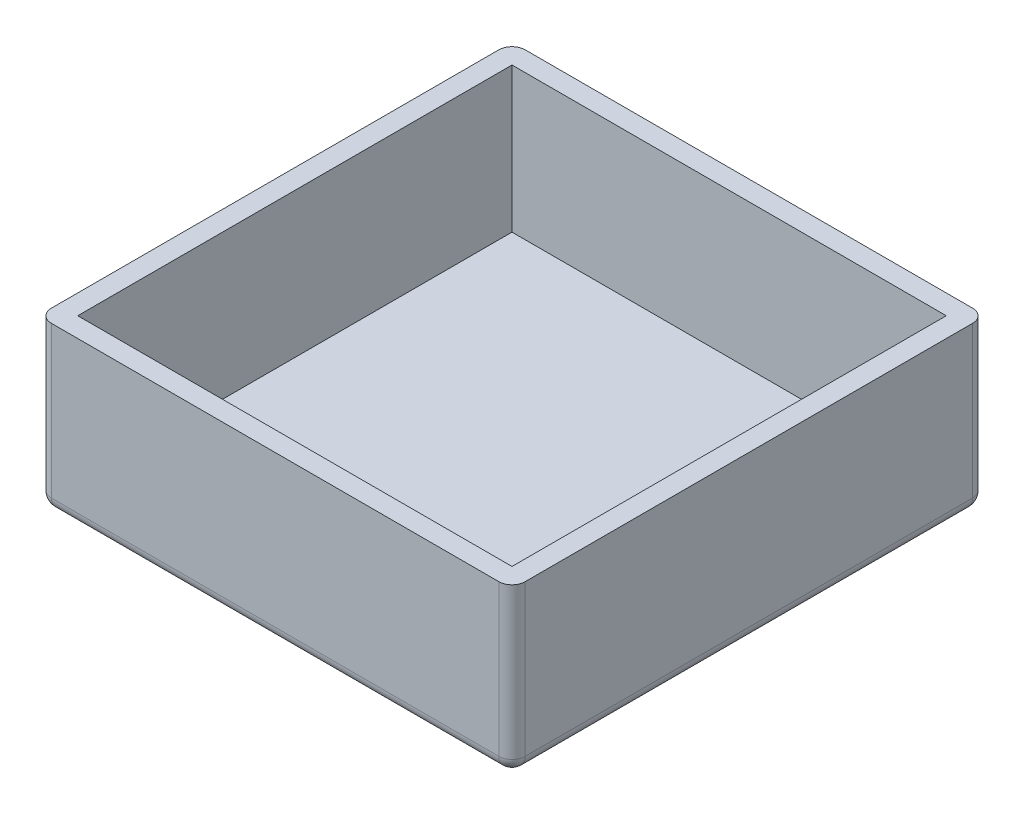
ISO-10303-21;
HEADER;
FILE_DESCRIPTION(('STEP AP214'),'2;1');
FILE_NAME('part.step','',(''),(''),'','','');
FILE_SCHEMA(('AUTOMOTIVE_DESIGN { 1 0 10303 214 1 1 1 1 }'));
ENDSEC;
DATA;
#1=APPLICATION_CONTEXT('core data for automotive mechanical design processes');
#2=APPLICATION_PROTOCOL_DEFINITION('international standard','automotive_design',2000,#1);
#3=PRODUCT_CONTEXT('',#1,'mechanical');
#4=PRODUCT('Part','Part','',(#3));
#5=PRODUCT_RELATED_PRODUCT_CATEGORY('part','',(#4));
#6=PRODUCT_DEFINITION_FORMATION('','',#4);
#7=PRODUCT_DEFINITION_CONTEXT('part definition',#1,'design');
#8=PRODUCT_DEFINITION('design','',#6,#7);
#9=PRODUCT_DEFINITION_SHAPE('','',#8);
#10=(LENGTH_UNIT() NAMED_UNIT(*) SI_UNIT(.MILLI.,.METRE.));
#11=(NAMED_UNIT(*) PLANE_ANGLE_UNIT() SI_UNIT($,.RADIAN.));
#12=(NAMED_UNIT(*) SI_UNIT($,.STERADIAN.) SOLID_ANGLE_UNIT());
#13=UNCERTAINTY_MEASURE_WITH_UNIT(LENGTH_MEASURE(1.E-05),#10,'distance_accuracy_value','');
#14=(GEOMETRIC_REPRESENTATION_CONTEXT(3) GLOBAL_UNCERTAINTY_ASSIGNED_CONTEXT((#13)) GLOBAL_UNIT_ASSIGNED_CONTEXT((#10,
#11,#12)) REPRESENTATION_CONTEXT('',''));
#15=CARTESIAN_POINT('',(0.,0.,0.));
#16=DIRECTION('',(0.,0.,1.));
#17=DIRECTION('',(1.,0.,0.));
#18=AXIS2_PLACEMENT_3D('',#15,#16,#17);
#19=CARTESIAN_POINT('',(0.,3.,0.));
#20=DIRECTION('',(0.,1.,0.));
#21=DIRECTION('',(0.,0.,1.));
#22=AXIS2_PLACEMENT_3D('',#19,#20,#21);
#23=PLANE('',#22);
#24=DIRECTION('',(0.,0.,-1.));
#25=VECTOR('',#24,1.);
#26=CARTESIAN_POINT('',(33.,3.,-33.));
#27=LINE('',#26,#25);
#28=CARTESIAN_POINT('',(33.,3.,33.));
#29=VERTEX_POINT('',#28);
#30=CARTESIAN_POINT('',(33.,3.,-33.));
#31=VERTEX_POINT('',#30);
#32=EDGE_CURVE('E211',#29,#31,#27,.T.);
#33=ORIENTED_EDGE('',*,*,#32,.T.);
#34=DIRECTION('',(-1.,0.,0.));
#35=VECTOR('',#34,1.);
#36=CARTESIAN_POINT('',(-33.,3.,-33.));
#37=LINE('',#36,#35);
#38=CARTESIAN_POINT('',(-33.,3.,-33.));
#39=VERTEX_POINT('',#38);
#40=EDGE_CURVE('E182',#31,#39,#37,.T.);
#41=ORIENTED_EDGE('',*,*,#40,.T.);
#42=DIRECTION('',(0.,0.,1.));
#43=VECTOR('',#42,1.);
#44=CARTESIAN_POINT('',(-33.,3.,-33.));
#45=LINE('',#44,#43);
#46=CARTESIAN_POINT('',(-33.,3.,33.));
#47=VERTEX_POINT('',#46);
#48=EDGE_CURVE('E214',#39,#47,#45,.T.);
#49=ORIENTED_EDGE('',*,*,#48,.T.);
#50=DIRECTION('',(1.,0.,0.));
#51=VECTOR('',#50,1.);
#52=CARTESIAN_POINT('',(-33.,3.,33.));
#53=LINE('',#52,#51);
#54=EDGE_CURVE('E217',#47,#29,#53,.T.);
#55=ORIENTED_EDGE('',*,*,#54,.T.);
#56=EDGE_LOOP('',(#33,#41,#49,#55));
#57=FACE_BOUND('',#56,.T.);
#58=ADVANCED_FACE('F63',(#57),#23,.T.);
#59=CARTESIAN_POINT('',(0.,25.,0.));
#60=DIRECTION('',(0.,1.,0.));
#61=DIRECTION('',(0.,0.,1.));
#62=AXIS2_PLACEMENT_3D('',#59,#60,#61);
#63=PLANE('',#62);
#64=DIRECTION('',(-1.,0.,0.));
#65=VECTOR('',#64,1.);
#66=CARTESIAN_POINT('',(-33.,25.,-36.));
#67=LINE('',#66,#65);
#68=CARTESIAN_POINT('',(34.,25.,-36.));
#69=VERTEX_POINT('',#68);
#70=CARTESIAN_POINT('',(-34.,25.,-36.));
#71=VERTEX_POINT('',#70);
#72=EDGE_CURVE('E202',#69,#71,#67,.T.);
#73=ORIENTED_EDGE('',*,*,#72,.T.);
#74=CARTESIAN_POINT('',(-34.,25.,-34.));
#75=DIRECTION('',(0.,1.,0.));
#76=DIRECTION('',(0.,0.,1.));
#77=AXIS2_PLACEMENT_3D('',#74,#75,#76);
#78=CIRCLE('',#77,2.);
#79=CARTESIAN_POINT('',(-36.,25.,-34.));
#80=VERTEX_POINT('',#79);
#81=EDGE_CURVE('E12',#71,#80,#78,.T.);
#82=ORIENTED_EDGE('',*,*,#81,.T.);
#83=DIRECTION('',(0.,0.,1.));
#84=VECTOR('',#83,1.);
#85=CARTESIAN_POINT('',(-36.,25.,-33.));
#86=LINE('',#85,#84);
#87=CARTESIAN_POINT('',(-36.,25.,34.));
#88=VERTEX_POINT('',#87);
#89=EDGE_CURVE('E205',#80,#88,#86,.T.);
#90=ORIENTED_EDGE('',*,*,#89,.T.);
#91=CARTESIAN_POINT('',(-34.,25.,34.));
#92=DIRECTION('',(0.,1.,0.));
#93=DIRECTION('',(0.,0.,1.));
#94=AXIS2_PLACEMENT_3D('',#91,#92,#93);
#95=CIRCLE('',#94,2.);
#96=CARTESIAN_POINT('',(-34.,25.,36.));
#97=VERTEX_POINT('',#96);
#98=EDGE_CURVE('E252',#88,#97,#95,.T.);
#99=ORIENTED_EDGE('',*,*,#98,.T.);
#100=DIRECTION('',(1.,0.,0.));
#101=VECTOR('',#100,1.);
#102=CARTESIAN_POINT('',(-33.,25.,36.));
#103=LINE('',#102,#101);
#104=CARTESIAN_POINT('',(34.,25.,36.));
#105=VERTEX_POINT('',#104);
#106=EDGE_CURVE('E208',#97,#105,#103,.T.);
#107=ORIENTED_EDGE('',*,*,#106,.T.);
#108=CARTESIAN_POINT('',(34.,25.,34.));
#109=DIRECTION('',(0.,1.,0.));
#110=DIRECTION('',(0.,0.,1.));
#111=AXIS2_PLACEMENT_3D('',#108,#109,#110);
#112=CIRCLE('',#111,2.);
#113=CARTESIAN_POINT('',(36.,25.,34.));
#114=VERTEX_POINT('',#113);
#115=EDGE_CURVE('E254',#105,#114,#112,.T.);
#116=ORIENTED_EDGE('',*,*,#115,.T.);
#117=DIRECTION('',(0.,0.,-1.));
#118=VECTOR('',#117,1.);
#119=CARTESIAN_POINT('',(36.,25.,-33.));
#120=LINE('',#119,#118);
#121=CARTESIAN_POINT('',(36.,25.,-34.));
#122=VERTEX_POINT('',#121);
#123=EDGE_CURVE('E183',#114,#122,#120,.T.);
#124=ORIENTED_EDGE('',*,*,#123,.T.);
#125=CARTESIAN_POINT('',(34.,25.,-34.));
#126=DIRECTION('',(0.,1.,0.));
#127=DIRECTION('',(0.,0.,1.));
#128=AXIS2_PLACEMENT_3D('',#125,#126,#127);
#129=CIRCLE('',#128,2.);
#130=EDGE_CURVE('E72',#122,#69,#129,.T.);
#131=ORIENTED_EDGE('',*,*,#130,.T.);
#132=EDGE_LOOP('',(#73,#82,#90,#99,#107,#116,#124,#131));
#133=FACE_BOUND('',#132,.T.);
#134=DIRECTION('',(-1.,0.,0.));
#135=VECTOR('',#134,1.);
#136=CARTESIAN_POINT('',(-33.,25.,-33.));
#137=LINE('',#136,#135);
#138=CARTESIAN_POINT('',(33.,25.,-33.));
#139=VERTEX_POINT('',#138);
#140=CARTESIAN_POINT('',(-33.,25.,-33.));
#141=VERTEX_POINT('',#140);
#142=EDGE_CURVE('E175',#139,#141,#137,.T.);
#143=ORIENTED_EDGE('',*,*,#142,.F.);
#144=DIRECTION('',(0.,0.,-1.));
#145=VECTOR('',#144,1.);
#146=CARTESIAN_POINT('',(33.,25.,-33.));
#147=LINE('',#146,#145);
#148=CARTESIAN_POINT('',(33.,25.,33.));
#149=VERTEX_POINT('',#148);
#150=EDGE_CURVE('E165',#149,#139,#147,.T.);
#151=ORIENTED_EDGE('',*,*,#150,.F.);
#152=DIRECTION('',(1.,0.,0.));
#153=VECTOR('',#152,1.);
#154=CARTESIAN_POINT('',(-33.,25.,33.));
#155=LINE('',#154,#153);
#156=CARTESIAN_POINT('',(-33.,25.,33.));
#157=VERTEX_POINT('',#156);
#158=EDGE_CURVE('E191',#157,#149,#155,.T.);
#159=ORIENTED_EDGE('',*,*,#158,.F.);
#160=DIRECTION('',(0.,0.,1.));
#161=VECTOR('',#160,1.);
#162=CARTESIAN_POINT('',(-33.,25.,-33.));
#163=LINE('',#162,#161);
#164=EDGE_CURVE('E189',#141,#157,#163,.T.);
#165=ORIENTED_EDGE('',*,*,#164,.F.);
#166=EDGE_LOOP('',(#143,#151,#159,#165));
#167=FACE_BOUND('',#166,.T.);
#168=ADVANCED_FACE('F187',(#133,#167),#63,.T.);
#169=CARTESIAN_POINT('',(36.,25.,-33.));
#170=DIRECTION('',(-1.,0.,0.));
#171=DIRECTION('',(0.,0.,1.));
#172=AXIS2_PLACEMENT_3D('',#169,#170,#171);
#173=PLANE('',#172);
#174=DIRECTION('',(0.,0.,-1.));
#175=VECTOR('',#174,1.);
#176=CARTESIAN_POINT('',(36.,2.,-33.));
#177=LINE('',#176,#175);
#178=CARTESIAN_POINT('',(36.,2.,34.));
#179=VERTEX_POINT('',#178);
#180=CARTESIAN_POINT('',(36.,2.,-34.));
#181=VERTEX_POINT('',#180);
#182=EDGE_CURVE('E222',#179,#181,#177,.T.);
#183=ORIENTED_EDGE('',*,*,#182,.T.);
#184=DIRECTION('',(0.,-1.,0.));
#185=VECTOR('',#184,1.);
#186=CARTESIAN_POINT('',(36.,25.,-34.));
#187=LINE('',#186,#185);
#188=EDGE_CURVE('E225',#181,#122,#187,.F.);
#189=ORIENTED_EDGE('',*,*,#188,.T.);
#190=ORIENTED_EDGE('',*,*,#123,.F.);
#191=DIRECTION('',(0.,-1.,0.));
#192=VECTOR('',#191,1.);
#193=CARTESIAN_POINT('',(36.,25.,34.));
#194=LINE('',#193,#192);
#195=EDGE_CURVE('E220',#114,#179,#194,.T.);
#196=ORIENTED_EDGE('',*,*,#195,.T.);
#197=EDGE_LOOP('',(#183,#189,#190,#196));
#198=FACE_BOUND('',#197,.T.);
#199=ADVANCED_FACE('F315',(#198),#173,.F.);
#200=CARTESIAN_POINT('',(-33.,25.,-36.));
#201=DIRECTION('',(0.,0.,1.));
#202=DIRECTION('',(1.,0.,0.));
#203=AXIS2_PLACEMENT_3D('',#200,#201,#202);
#204=PLANE('',#203);
#205=DIRECTION('',(-1.,0.,0.));
#206=VECTOR('',#205,1.);
#207=CARTESIAN_POINT('',(-33.,2.,-36.));
#208=LINE('',#207,#206);
#209=CARTESIAN_POINT('',(34.,2.,-36.));
#210=VERTEX_POINT('',#209);
#211=CARTESIAN_POINT('',(-34.,2.,-36.));
#212=VERTEX_POINT('',#211);
#213=EDGE_CURVE('E80',#210,#212,#208,.T.);
#214=ORIENTED_EDGE('',*,*,#213,.T.);
#215=DIRECTION('',(0.,-1.,0.));
#216=VECTOR('',#215,1.);
#217=CARTESIAN_POINT('',(-34.,25.,-36.));
#218=LINE('',#217,#216);
#219=EDGE_CURVE('E250',#212,#71,#218,.F.);
#220=ORIENTED_EDGE('',*,*,#219,.T.);
#221=ORIENTED_EDGE('',*,*,#72,.F.);
#222=DIRECTION('',(0.,-1.,0.));
#223=VECTOR('',#222,1.);
#224=CARTESIAN_POINT('',(34.,25.,-36.));
#225=LINE('',#224,#223);
#226=EDGE_CURVE('E85',#69,#210,#225,.T.);
#227=ORIENTED_EDGE('',*,*,#226,.T.);
#228=EDGE_LOOP('',(#214,#220,#221,#227));
#229=FACE_BOUND('',#228,.T.);
#230=ADVANCED_FACE('F322',(#229),#204,.F.);
#231=CARTESIAN_POINT('',(-36.,25.,-33.));
#232=DIRECTION('',(1.,0.,0.));
#233=DIRECTION('',(0.,0.,-1.));
#234=AXIS2_PLACEMENT_3D('',#231,#232,#233);
#235=PLANE('',#234);
#236=ORIENTED_EDGE('',*,*,#89,.F.);
#237=DIRECTION('',(0.,-1.,0.));
#238=VECTOR('',#237,1.);
#239=CARTESIAN_POINT('',(-36.,25.,-34.));
#240=LINE('',#239,#238);
#241=CARTESIAN_POINT('',(-36.,2.,-34.));
#242=VERTEX_POINT('',#241);
#243=EDGE_CURVE('E246',#80,#242,#240,.T.);
#244=ORIENTED_EDGE('',*,*,#243,.T.);
#245=DIRECTION('',(0.,0.,1.));
#246=VECTOR('',#245,1.);
#247=CARTESIAN_POINT('',(-36.,2.,-33.));
#248=LINE('',#247,#246);
#249=CARTESIAN_POINT('',(-36.,2.,34.));
#250=VERTEX_POINT('',#249);
#251=EDGE_CURVE('E244',#242,#250,#248,.T.);
#252=ORIENTED_EDGE('',*,*,#251,.T.);
#253=DIRECTION('',(0.,-1.,0.));
#254=VECTOR('',#253,1.);
#255=CARTESIAN_POINT('',(-36.,25.,34.));
#256=LINE('',#255,#254);
#257=EDGE_CURVE('E242',#250,#88,#256,.F.);
#258=ORIENTED_EDGE('',*,*,#257,.T.);
#259=EDGE_LOOP('',(#236,#244,#252,#258));
#260=FACE_BOUND('',#259,.T.);
#261=ADVANCED_FACE('F342',(#260),#235,.F.);
#262=CARTESIAN_POINT('',(-33.,25.,36.));
#263=DIRECTION('',(0.,0.,-1.));
#264=DIRECTION('',(-1.,0.,0.));
#265=AXIS2_PLACEMENT_3D('',#262,#263,#264);
#266=PLANE('',#265);
#267=DIRECTION('',(1.,0.,0.));
#268=VECTOR('',#267,1.);
#269=CARTESIAN_POINT('',(-33.,2.,36.));
#270=LINE('',#269,#268);
#271=CARTESIAN_POINT('',(-34.,2.,36.));
#272=VERTEX_POINT('',#271);
#273=CARTESIAN_POINT('',(34.,2.,36.));
#274=VERTEX_POINT('',#273);
#275=EDGE_CURVE('E238',#272,#274,#270,.T.);
#276=ORIENTED_EDGE('',*,*,#275,.T.);
#277=DIRECTION('',(0.,-1.,0.));
#278=VECTOR('',#277,1.);
#279=CARTESIAN_POINT('',(34.,25.,36.));
#280=LINE('',#279,#278);
#281=EDGE_CURVE('E240',#274,#105,#280,.F.);
#282=ORIENTED_EDGE('',*,*,#281,.T.);
#283=ORIENTED_EDGE('',*,*,#106,.F.);
#284=DIRECTION('',(0.,-1.,0.));
#285=VECTOR('',#284,1.);
#286=CARTESIAN_POINT('',(-34.,25.,36.));
#287=LINE('',#286,#285);
#288=EDGE_CURVE('E236',#97,#272,#287,.T.);
#289=ORIENTED_EDGE('',*,*,#288,.T.);
#290=EDGE_LOOP('',(#276,#282,#283,#289));
#291=FACE_BOUND('',#290,.T.);
#292=ADVANCED_FACE('F302',(#291),#266,.F.);
#293=CARTESIAN_POINT('',(33.,25.,-33.));
#294=DIRECTION('',(-1.,0.,0.));
#295=DIRECTION('',(0.,0.,1.));
#296=AXIS2_PLACEMENT_3D('',#293,#294,#295);
#297=PLANE('',#296);
#298=DIRECTION('',(0.,-1.,0.));
#299=VECTOR('',#298,1.);
#300=CARTESIAN_POINT('',(33.,25.,-33.));
#301=LINE('',#300,#299);
#302=EDGE_CURVE('E169',#139,#31,#301,.T.);
#303=ORIENTED_EDGE('',*,*,#302,.T.);
#304=ORIENTED_EDGE('',*,*,#32,.F.);
#305=DIRECTION('',(0.,-1.,0.));
#306=VECTOR('',#305,1.);
#307=CARTESIAN_POINT('',(33.,25.,33.));
#308=LINE('',#307,#306);
#309=EDGE_CURVE('E171',#149,#29,#308,.T.);
#310=ORIENTED_EDGE('',*,*,#309,.F.);
#311=ORIENTED_EDGE('',*,*,#150,.T.);
#312=EDGE_LOOP('',(#303,#304,#310,#311));
#313=FACE_BOUND('',#312,.T.);
#314=ADVANCED_FACE('F167',(#313),#297,.T.);
#315=CARTESIAN_POINT('',(-33.,25.,-33.));
#316=DIRECTION('',(0.,0.,1.));
#317=DIRECTION('',(1.,0.,0.));
#318=AXIS2_PLACEMENT_3D('',#315,#316,#317);
#319=PLANE('',#318);
#320=DIRECTION('',(0.,-1.,0.));
#321=VECTOR('',#320,1.);
#322=CARTESIAN_POINT('',(-33.,25.,-33.));
#323=LINE('',#322,#321);
#324=EDGE_CURVE('E184',#141,#39,#323,.T.);
#325=ORIENTED_EDGE('',*,*,#324,.T.);
#326=ORIENTED_EDGE('',*,*,#40,.F.);
#327=ORIENTED_EDGE('',*,*,#302,.F.);
#328=ORIENTED_EDGE('',*,*,#142,.T.);
#329=EDGE_LOOP('',(#325,#326,#327,#328));
#330=FACE_BOUND('',#329,.T.);
#331=ADVANCED_FACE('F179',(#330),#319,.T.);
#332=CARTESIAN_POINT('',(-33.,25.,-33.));
#333=DIRECTION('',(1.,0.,0.));
#334=DIRECTION('',(0.,0.,-1.));
#335=AXIS2_PLACEMENT_3D('',#332,#333,#334);
#336=PLANE('',#335);
#337=DIRECTION('',(0.,-1.,0.));
#338=VECTOR('',#337,1.);
#339=CARTESIAN_POINT('',(-33.,25.,33.));
#340=LINE('',#339,#338);
#341=EDGE_CURVE('E196',#157,#47,#340,.T.);
#342=ORIENTED_EDGE('',*,*,#341,.T.);
#343=ORIENTED_EDGE('',*,*,#48,.F.);
#344=ORIENTED_EDGE('',*,*,#324,.F.);
#345=ORIENTED_EDGE('',*,*,#164,.T.);
#346=EDGE_LOOP('',(#342,#343,#344,#345));
#347=FACE_BOUND('',#346,.T.);
#348=ADVANCED_FACE('F500',(#347),#336,.T.);
#349=CARTESIAN_POINT('',(-33.,25.,33.));
#350=DIRECTION('',(0.,0.,-1.));
#351=DIRECTION('',(-1.,0.,0.));
#352=AXIS2_PLACEMENT_3D('',#349,#350,#351);
#353=PLANE('',#352);
#354=ORIENTED_EDGE('',*,*,#309,.T.);
#355=ORIENTED_EDGE('',*,*,#54,.F.);
#356=ORIENTED_EDGE('',*,*,#341,.F.);
#357=ORIENTED_EDGE('',*,*,#158,.T.);
#358=EDGE_LOOP('',(#354,#355,#356,#357));
#359=FACE_BOUND('',#358,.T.);
#360=ADVANCED_FACE('F350',(#359),#353,.T.);
#361=CARTESIAN_POINT('',(0.,0.,0.));
#362=DIRECTION('',(0.,1.,0.));
#363=DIRECTION('',(0.,0.,1.));
#364=AXIS2_PLACEMENT_3D('',#361,#362,#363);
#365=PLANE('',#364);
#366=DIRECTION('',(-1.,0.,0.));
#367=VECTOR('',#366,1.);
#368=CARTESIAN_POINT('',(0.,0.,-34.));
#369=LINE('',#368,#367);
#370=CARTESIAN_POINT('',(-34.,0.,-34.));
#371=VERTEX_POINT('',#370);
#372=CARTESIAN_POINT('',(34.,0.,-34.));
#373=VERTEX_POINT('',#372);
#374=EDGE_CURVE('E227',#371,#373,#369,.F.);
#375=ORIENTED_EDGE('',*,*,#374,.T.);
#376=DIRECTION('',(0.,0.,-1.));
#377=VECTOR('',#376,1.);
#378=CARTESIAN_POINT('',(34.,0.,0.));
#379=LINE('',#378,#377);
#380=CARTESIAN_POINT('',(34.,0.,34.));
#381=VERTEX_POINT('',#380);
#382=EDGE_CURVE('E233',#373,#381,#379,.F.);
#383=ORIENTED_EDGE('',*,*,#382,.T.);
#384=DIRECTION('',(1.,0.,0.));
#385=VECTOR('',#384,1.);
#386=CARTESIAN_POINT('',(0.,0.,34.));
#387=LINE('',#386,#385);
#388=CARTESIAN_POINT('',(-34.,0.,34.));
#389=VERTEX_POINT('',#388);
#390=EDGE_CURVE('E231',#381,#389,#387,.F.);
#391=ORIENTED_EDGE('',*,*,#390,.T.);
#392=DIRECTION('',(0.,0.,1.));
#393=VECTOR('',#392,1.);
#394=CARTESIAN_POINT('',(-34.,0.,0.));
#395=LINE('',#394,#393);
#396=EDGE_CURVE('E229',#389,#371,#395,.F.);
#397=ORIENTED_EDGE('',*,*,#396,.T.);
#398=EDGE_LOOP('',(#375,#383,#391,#397));
#399=FACE_BOUND('',#398,.T.);
#400=ADVANCED_FACE('F337',(#399),#365,.F.);
#401=CARTESIAN_POINT('',(-34.,25.,34.));
#402=DIRECTION('',(0.,-1.,0.));
#403=DIRECTION('',(0.,0.,-1.));
#404=AXIS2_PLACEMENT_3D('',#401,#402,#403);
#405=CYLINDRICAL_SURFACE('',#404,2.);
#406=ORIENTED_EDGE('',*,*,#98,.F.);
#407=ORIENTED_EDGE('',*,*,#257,.F.);
#408=CARTESIAN_POINT('',(-34.,2.,34.));
#409=DIRECTION('',(0.,-1.,0.));
#410=DIRECTION('',(0.,0.,-1.));
#411=AXIS2_PLACEMENT_3D('',#408,#409,#410);
#412=CIRCLE('',#411,2.);
#413=EDGE_CURVE('E284',#272,#250,#412,.T.);
#414=ORIENTED_EDGE('',*,*,#413,.F.);
#415=ORIENTED_EDGE('',*,*,#288,.F.);
#416=EDGE_LOOP('',(#406,#407,#414,#415));
#417=FACE_BOUND('',#416,.T.);
#418=ADVANCED_FACE('F65',(#417),#405,.T.);
#419=CARTESIAN_POINT('',(-34.,25.,-34.));
#420=DIRECTION('',(0.,-1.,0.));
#421=DIRECTION('',(0.,0.,-1.));
#422=AXIS2_PLACEMENT_3D('',#419,#420,#421);
#423=CYLINDRICAL_SURFACE('',#422,2.);
#424=ORIENTED_EDGE('',*,*,#81,.F.);
#425=ORIENTED_EDGE('',*,*,#219,.F.);
#426=CARTESIAN_POINT('',(-34.,2.,-34.));
#427=DIRECTION('',(0.,-1.,0.));
#428=DIRECTION('',(0.,0.,-1.));
#429=AXIS2_PLACEMENT_3D('',#426,#427,#428);
#430=CIRCLE('',#429,2.);
#431=EDGE_CURVE('E282',#242,#212,#430,.T.);
#432=ORIENTED_EDGE('',*,*,#431,.F.);
#433=ORIENTED_EDGE('',*,*,#243,.F.);
#434=EDGE_LOOP('',(#424,#425,#432,#433));
#435=FACE_BOUND('',#434,.T.);
#436=ADVANCED_FACE('F325',(#435),#423,.T.);
#437=CARTESIAN_POINT('',(-34.,2.,-33.));
#438=DIRECTION('',(0.,0.,1.));
#439=DIRECTION('',(1.,0.,0.));
#440=AXIS2_PLACEMENT_3D('',#437,#438,#439);
#441=CYLINDRICAL_SURFACE('',#440,2.);
#442=CARTESIAN_POINT('',(-34.,2.,34.));
#443=DIRECTION('',(0.,0.,1.));
#444=DIRECTION('',(1.,0.,0.));
#445=AXIS2_PLACEMENT_3D('',#442,#443,#444);
#446=CIRCLE('',#445,2.);
#447=EDGE_CURVE('E67',#250,#389,#446,.T.);
#448=ORIENTED_EDGE('',*,*,#447,.F.);
#449=ORIENTED_EDGE('',*,*,#251,.F.);
#450=CARTESIAN_POINT('',(-34.,2.,-34.));
#451=DIRECTION('',(0.,0.,-1.));
#452=DIRECTION('',(-1.,0.,0.));
#453=AXIS2_PLACEMENT_3D('',#450,#451,#452);
#454=CIRCLE('',#453,2.);
#455=EDGE_CURVE('E279',#371,#242,#454,.T.);
#456=ORIENTED_EDGE('',*,*,#455,.F.);
#457=ORIENTED_EDGE('',*,*,#396,.F.);
#458=EDGE_LOOP('',(#448,#449,#456,#457));
#459=FACE_BOUND('',#458,.T.);
#460=ADVANCED_FACE('F338',(#459),#441,.T.);
#461=CARTESIAN_POINT('',(-34.,2.,34.));
#462=DIRECTION('',(-1.,0.,0.));
#463=DIRECTION('',(0.,-1.,0.));
#464=AXIS2_PLACEMENT_3D('',#461,#462,#463);
#465=SPHERICAL_SURFACE('',#464,2.);
#466=ORIENTED_EDGE('',*,*,#413,.T.);
#467=ORIENTED_EDGE('',*,*,#447,.T.);
#468=CARTESIAN_POINT('',(-34.,2.,34.));
#469=DIRECTION('',(-1.,0.,0.));
#470=DIRECTION('',(0.,0.,1.));
#471=AXIS2_PLACEMENT_3D('',#468,#469,#470);
#472=CIRCLE('',#471,2.);
#473=EDGE_CURVE('E276',#272,#389,#472,.F.);
#474=ORIENTED_EDGE('',*,*,#473,.F.);
#475=EDGE_LOOP('',(#466,#467,#474));
#476=FACE_BOUND('',#475,.T.);
#477=ADVANCED_FACE('F291',(#476),#465,.T.);
#478=CARTESIAN_POINT('',(-34.,2.,-34.));
#479=DIRECTION('',(-1.,0.,0.));
#480=DIRECTION('',(0.,-1.,0.));
#481=AXIS2_PLACEMENT_3D('',#478,#479,#480);
#482=SPHERICAL_SURFACE('',#481,2.);
#483=ORIENTED_EDGE('',*,*,#455,.T.);
#484=ORIENTED_EDGE('',*,*,#431,.T.);
#485=CARTESIAN_POINT('',(-34.,2.,-34.));
#486=DIRECTION('',(-1.,0.,0.));
#487=DIRECTION('',(0.,0.,1.));
#488=AXIS2_PLACEMENT_3D('',#485,#486,#487);
#489=CIRCLE('',#488,2.);
#490=EDGE_CURVE('E273',#371,#212,#489,.F.);
#491=ORIENTED_EDGE('',*,*,#490,.F.);
#492=EDGE_LOOP('',(#483,#484,#491));
#493=FACE_BOUND('',#492,.T.);
#494=ADVANCED_FACE('F329',(#493),#482,.T.);
#495=CARTESIAN_POINT('',(-33.,2.,34.));
#496=DIRECTION('',(1.,0.,0.));
#497=DIRECTION('',(0.,0.,-1.));
#498=AXIS2_PLACEMENT_3D('',#495,#496,#497);
#499=CYLINDRICAL_SURFACE('',#498,2.);
#500=ORIENTED_EDGE('',*,*,#473,.T.);
#501=ORIENTED_EDGE('',*,*,#390,.F.);
#502=CARTESIAN_POINT('',(34.,2.,34.));
#503=DIRECTION('',(1.,0.,0.));
#504=DIRECTION('',(0.,0.,-1.));
#505=AXIS2_PLACEMENT_3D('',#502,#503,#504);
#506=CIRCLE('',#505,2.);
#507=EDGE_CURVE('E270',#274,#381,#506,.T.);
#508=ORIENTED_EDGE('',*,*,#507,.F.);
#509=ORIENTED_EDGE('',*,*,#275,.F.);
#510=EDGE_LOOP('',(#500,#501,#508,#509));
#511=FACE_BOUND('',#510,.T.);
#512=ADVANCED_FACE('F298',(#511),#499,.T.);
#513=CARTESIAN_POINT('',(34.,25.,34.));
#514=DIRECTION('',(0.,-1.,0.));
#515=DIRECTION('',(0.,0.,-1.));
#516=AXIS2_PLACEMENT_3D('',#513,#514,#515);
#517=CYLINDRICAL_SURFACE('',#516,2.);
#518=ORIENTED_EDGE('',*,*,#115,.F.);
#519=ORIENTED_EDGE('',*,*,#281,.F.);
#520=CARTESIAN_POINT('',(34.,2.,34.));
#521=DIRECTION('',(0.,-1.,0.));
#522=DIRECTION('',(0.,0.,-1.));
#523=AXIS2_PLACEMENT_3D('',#520,#521,#522);
#524=CIRCLE('',#523,2.);
#525=EDGE_CURVE('E267',#179,#274,#524,.T.);
#526=ORIENTED_EDGE('',*,*,#525,.F.);
#527=ORIENTED_EDGE('',*,*,#195,.F.);
#528=EDGE_LOOP('',(#518,#519,#526,#527));
#529=FACE_BOUND('',#528,.T.);
#530=ADVANCED_FACE('F308',(#529),#517,.T.);
#531=CARTESIAN_POINT('',(34.,25.,-34.));
#532=DIRECTION('',(0.,-1.,0.));
#533=DIRECTION('',(0.,0.,-1.));
#534=AXIS2_PLACEMENT_3D('',#531,#532,#533);
#535=CYLINDRICAL_SURFACE('',#534,2.);
#536=ORIENTED_EDGE('',*,*,#130,.F.);
#537=ORIENTED_EDGE('',*,*,#188,.F.);
#538=CARTESIAN_POINT('',(34.,2.,-34.));
#539=DIRECTION('',(0.,-1.,0.));
#540=DIRECTION('',(0.,0.,-1.));
#541=AXIS2_PLACEMENT_3D('',#538,#539,#540);
#542=CIRCLE('',#541,2.);
#543=EDGE_CURVE('E264',#210,#181,#542,.T.);
#544=ORIENTED_EDGE('',*,*,#543,.F.);
#545=ORIENTED_EDGE('',*,*,#226,.F.);
#546=EDGE_LOOP('',(#536,#537,#544,#545));
#547=FACE_BOUND('',#546,.T.);
#548=ADVANCED_FACE('F320',(#547),#535,.T.);
#549=CARTESIAN_POINT('',(-33.,2.,-34.));
#550=DIRECTION('',(-1.,0.,0.));
#551=DIRECTION('',(0.,0.,1.));
#552=AXIS2_PLACEMENT_3D('',#549,#550,#551);
#553=CYLINDRICAL_SURFACE('',#552,2.);
#554=ORIENTED_EDGE('',*,*,#490,.T.);
#555=ORIENTED_EDGE('',*,*,#213,.F.);
#556=CARTESIAN_POINT('',(34.,2.,-34.));
#557=DIRECTION('',(1.,0.,0.));
#558=DIRECTION('',(0.,0.,-1.));
#559=AXIS2_PLACEMENT_3D('',#556,#557,#558);
#560=CIRCLE('',#559,2.);
#561=EDGE_CURVE('E261',#373,#210,#560,.T.);
#562=ORIENTED_EDGE('',*,*,#561,.F.);
#563=ORIENTED_EDGE('',*,*,#374,.F.);
#564=EDGE_LOOP('',(#554,#555,#562,#563));
#565=FACE_BOUND('',#564,.T.);
#566=ADVANCED_FACE('F333',(#565),#553,.T.);
#567=CARTESIAN_POINT('',(34.,2.,34.));
#568=DIRECTION('',(0.,0.,1.));
#569=DIRECTION('',(0.,-1.,0.));
#570=AXIS2_PLACEMENT_3D('',#567,#568,#569);
#571=SPHERICAL_SURFACE('',#570,2.);
#572=ORIENTED_EDGE('',*,*,#525,.T.);
#573=ORIENTED_EDGE('',*,*,#507,.T.);
#574=CARTESIAN_POINT('',(34.,2.,34.));
#575=DIRECTION('',(0.,0.,1.));
#576=DIRECTION('',(1.,0.,0.));
#577=AXIS2_PLACEMENT_3D('',#574,#575,#576);
#578=CIRCLE('',#577,2.);
#579=EDGE_CURVE('E259',#179,#381,#578,.F.);
#580=ORIENTED_EDGE('',*,*,#579,.F.);
#581=EDGE_LOOP('',(#572,#573,#580));
#582=FACE_BOUND('',#581,.T.);
#583=ADVANCED_FACE('F369',(#582),#571,.T.);
#584=CARTESIAN_POINT('',(34.,2.,-34.));
#585=DIRECTION('',(0.,0.,-1.));
#586=DIRECTION('',(0.,1.,0.));
#587=AXIS2_PLACEMENT_3D('',#584,#585,#586);
#588=SPHERICAL_SURFACE('',#587,2.);
#589=ORIENTED_EDGE('',*,*,#561,.T.);
#590=ORIENTED_EDGE('',*,*,#543,.T.);
#591=CARTESIAN_POINT('',(34.,2.,-34.));
#592=DIRECTION('',(0.,0.,-1.));
#593=DIRECTION('',(-1.,0.,0.));
#594=AXIS2_PLACEMENT_3D('',#591,#592,#593);
#595=CIRCLE('',#594,2.);
#596=EDGE_CURVE('E257',#373,#181,#595,.F.);
#597=ORIENTED_EDGE('',*,*,#596,.F.);
#598=EDGE_LOOP('',(#589,#590,#597));
#599=FACE_BOUND('',#598,.T.);
#600=ADVANCED_FACE('F365',(#599),#588,.T.);
#601=CARTESIAN_POINT('',(34.,2.,-33.));
#602=DIRECTION('',(0.,0.,-1.));
#603=DIRECTION('',(-1.,0.,0.));
#604=AXIS2_PLACEMENT_3D('',#601,#602,#603);
#605=CYLINDRICAL_SURFACE('',#604,2.);
#606=ORIENTED_EDGE('',*,*,#579,.T.);
#607=ORIENTED_EDGE('',*,*,#382,.F.);
#608=ORIENTED_EDGE('',*,*,#596,.T.);
#609=ORIENTED_EDGE('',*,*,#182,.F.);
#610=EDGE_LOOP('',(#606,#607,#608,#609));
#611=FACE_BOUND('',#610,.T.);
#612=ADVANCED_FACE('F362',(#611),#605,.T.);
#613=CLOSED_SHELL('',(#58,#168,#199,#230,#261,#292,#314,#331,#348,#360,#400,#418,#436,#460,#477,
#494,#512,#530,#548,#566,#583,#600,#612));
#614=MANIFOLD_SOLID_BREP('B2',#613);
#615=ADVANCED_BREP_SHAPE_REPRESENTATION('',(#18,#614),#14);
#616=SHAPE_DEFINITION_REPRESENTATION(#9,#615);
ENDSEC;
END-ISO-10303-21;
